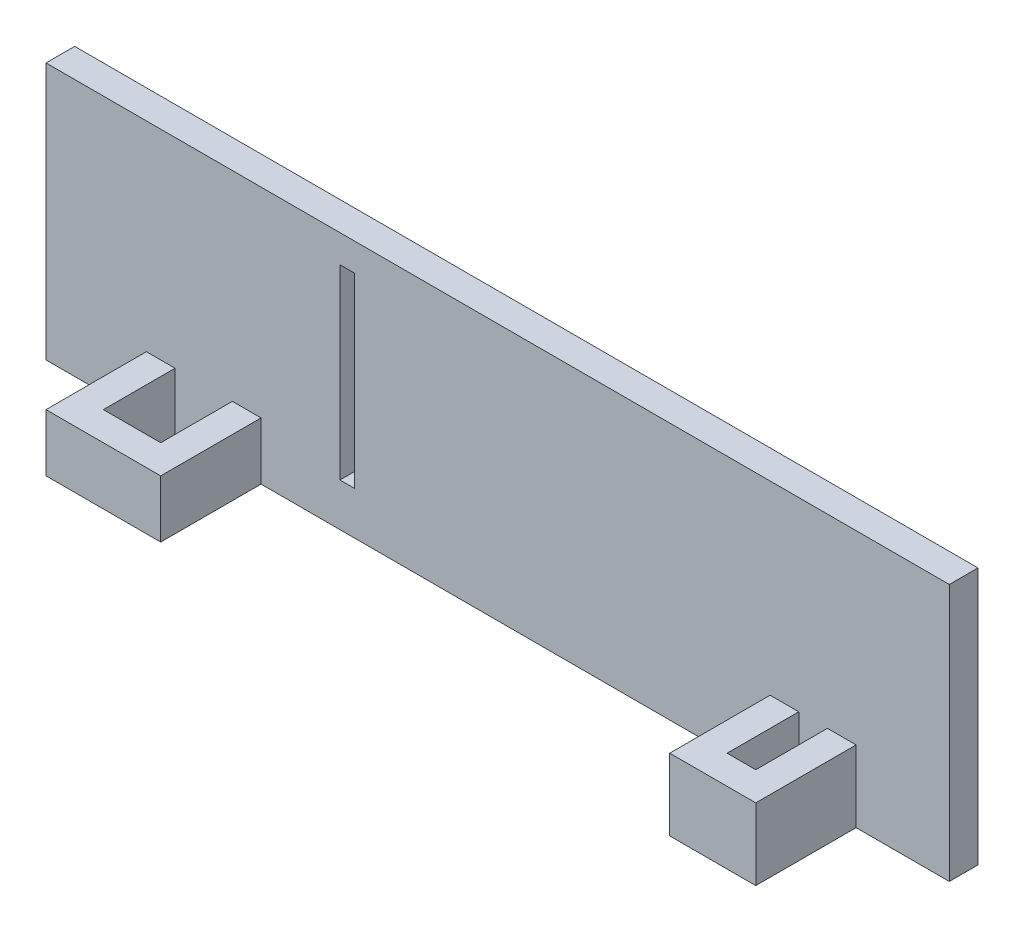
ISO-10303-21;
HEADER;
FILE_DESCRIPTION(('STEP AP214'),'2;1');
FILE_NAME('part.step','',(''),(''),'','','');
FILE_SCHEMA(('AUTOMOTIVE_DESIGN { 1 0 10303 214 1 1 1 1 }'));
ENDSEC;
DATA;
#1=APPLICATION_CONTEXT('core data for automotive mechanical design processes');
#2=APPLICATION_PROTOCOL_DEFINITION('international standard','automotive_design',2000,#1);
#3=PRODUCT_CONTEXT('',#1,'mechanical');
#4=PRODUCT('Part','Part','',(#3));
#5=PRODUCT_RELATED_PRODUCT_CATEGORY('part','',(#4));
#6=PRODUCT_DEFINITION_FORMATION('','',#4);
#7=PRODUCT_DEFINITION_CONTEXT('part definition',#1,'design');
#8=PRODUCT_DEFINITION('design','',#6,#7);
#9=PRODUCT_DEFINITION_SHAPE('','',#8);
#10=(LENGTH_UNIT() NAMED_UNIT(*) SI_UNIT(.MILLI.,.METRE.));
#11=(NAMED_UNIT(*) PLANE_ANGLE_UNIT() SI_UNIT($,.RADIAN.));
#12=(NAMED_UNIT(*) SI_UNIT($,.STERADIAN.) SOLID_ANGLE_UNIT());
#13=UNCERTAINTY_MEASURE_WITH_UNIT(LENGTH_MEASURE(1.E-05),#10,'distance_accuracy_value','');
#14=(GEOMETRIC_REPRESENTATION_CONTEXT(3) GLOBAL_UNCERTAINTY_ASSIGNED_CONTEXT((#13)) GLOBAL_UNIT_ASSIGNED_CONTEXT((#10,
#11,#12)) REPRESENTATION_CONTEXT('',''));
#15=CARTESIAN_POINT('',(0.,0.,0.));
#16=DIRECTION('',(0.,0.,1.));
#17=DIRECTION('',(1.,0.,0.));
#18=AXIS2_PLACEMENT_3D('',#15,#16,#17);
#19=CARTESIAN_POINT('',(0.,0.,2.));
#20=DIRECTION('',(0.,0.,1.));
#21=DIRECTION('',(1.,0.,0.));
#22=AXIS2_PLACEMENT_3D('',#19,#20,#21);
#23=PLANE('',#22);
#24=DIRECTION('',(1.,0.,0.));
#25=VECTOR('',#24,1.);
#26=CARTESIAN_POINT('',(0.,-84.5096429935089,2.));
#27=LINE('',#26,#25);
#28=CARTESIAN_POINT('',(0.,-84.5096429935089,2.));
#29=VERTEX_POINT('',#28);
#30=CARTESIAN_POINT('',(63.,-84.5096429935089,2.));
#31=VERTEX_POINT('',#30);
#32=EDGE_CURVE('E389',#29,#31,#27,.T.);
#33=ORIENTED_EDGE('',*,*,#32,.F.);
#34=DIRECTION('',(0.,-1.,0.));
#35=VECTOR('',#34,1.);
#36=CARTESIAN_POINT('',(0.,0.,2.));
#37=LINE('',#36,#35);
#38=CARTESIAN_POINT('',(0.,-102.45,2.));
#39=VERTEX_POINT('',#38);
#40=EDGE_CURVE('E207',#29,#39,#37,.T.);
#41=ORIENTED_EDGE('',*,*,#40,.T.);
#42=DIRECTION('',(1.,0.,0.));
#43=VECTOR('',#42,1.);
#44=CARTESIAN_POINT('',(0.,-102.45,2.));
#45=LINE('',#44,#43);
#46=CARTESIAN_POINT('',(7.,-102.45,2.));
#47=VERTEX_POINT('',#46);
#48=EDGE_CURVE('E217',#39,#47,#45,.T.);
#49=ORIENTED_EDGE('',*,*,#48,.T.);
#50=DIRECTION('',(0.,-1.,0.));
#51=VECTOR('',#50,1.);
#52=CARTESIAN_POINT('',(7.,-102.45,2.));
#53=LINE('',#52,#51);
#54=CARTESIAN_POINT('',(7.,-98.45,2.));
#55=VERTEX_POINT('',#54);
#56=EDGE_CURVE('E345',#55,#47,#53,.T.);
#57=ORIENTED_EDGE('',*,*,#56,.F.);
#58=DIRECTION('',(-1.,0.,0.));
#59=VECTOR('',#58,1.);
#60=CARTESIAN_POINT('',(7.,-98.45,2.));
#61=LINE('',#60,#59);
#62=CARTESIAN_POINT('',(9.,-98.45,2.));
#63=VERTEX_POINT('',#62);
#64=EDGE_CURVE('E362',#63,#55,#61,.T.);
#65=ORIENTED_EDGE('',*,*,#64,.F.);
#66=DIRECTION('',(0.,-1.,0.));
#67=VECTOR('',#66,1.);
#68=CARTESIAN_POINT('',(9.,-97.45,2.));
#69=LINE('',#68,#67);
#70=CARTESIAN_POINT('',(9.,-102.45,2.));
#71=VERTEX_POINT('',#70);
#72=EDGE_CURVE('E278',#63,#71,#69,.T.);
#73=ORIENTED_EDGE('',*,*,#72,.T.);
#74=DIRECTION('',(1.,0.,0.));
#75=VECTOR('',#74,1.);
#76=CARTESIAN_POINT('',(9.,-102.45,2.));
#77=LINE('',#76,#75);
#78=CARTESIAN_POINT('',(13.,-102.45,2.));
#79=VERTEX_POINT('',#78);
#80=EDGE_CURVE('E268',#71,#79,#77,.T.);
#81=ORIENTED_EDGE('',*,*,#80,.T.);
#82=DIRECTION('',(0.,-1.,0.));
#83=VECTOR('',#82,1.);
#84=CARTESIAN_POINT('',(13.,-97.45,2.));
#85=LINE('',#84,#83);
#86=CARTESIAN_POINT('',(13.,-98.45,2.));
#87=VERTEX_POINT('',#86);
#88=EDGE_CURVE('E284',#87,#79,#85,.T.);
#89=ORIENTED_EDGE('',*,*,#88,.F.);
#90=CARTESIAN_POINT('',(15.,-98.45,2.));
#91=VERTEX_POINT('',#90);
#92=EDGE_CURVE('E350',#91,#87,#61,.T.);
#93=ORIENTED_EDGE('',*,*,#92,.F.);
#94=DIRECTION('',(0.,1.,0.));
#95=VECTOR('',#94,1.);
#96=CARTESIAN_POINT('',(15.,-102.45,2.));
#97=LINE('',#96,#95);
#98=CARTESIAN_POINT('',(15.,-102.45,2.));
#99=VERTEX_POINT('',#98);
#100=EDGE_CURVE('E359',#99,#91,#97,.T.);
#101=ORIENTED_EDGE('',*,*,#100,.F.);
#102=CARTESIAN_POINT('',(50.5,-102.45,2.));
#103=VERTEX_POINT('',#102);
#104=EDGE_CURVE('E375',#99,#103,#45,.T.);
#105=ORIENTED_EDGE('',*,*,#104,.T.);
#106=DIRECTION('',(0.,-1.,0.));
#107=VECTOR('',#106,1.);
#108=CARTESIAN_POINT('',(50.5,-102.45,2.));
#109=LINE('',#108,#107);
#110=CARTESIAN_POINT('',(50.5,-97.45,2.));
#111=VERTEX_POINT('',#110);
#112=EDGE_CURVE('E281',#111,#103,#109,.T.);
#113=ORIENTED_EDGE('',*,*,#112,.F.);
#114=DIRECTION('',(-1.,0.,0.));
#115=VECTOR('',#114,1.);
#116=CARTESIAN_POINT('',(50.5,-97.45,2.));
#117=LINE('',#116,#115);
#118=CARTESIAN_POINT('',(52.5,-97.45,2.));
#119=VERTEX_POINT('',#118);
#120=EDGE_CURVE('E331',#119,#111,#117,.T.);
#121=ORIENTED_EDGE('',*,*,#120,.F.);
#122=DIRECTION('',(0.,-1.,0.));
#123=VECTOR('',#122,1.);
#124=CARTESIAN_POINT('',(52.5,-97.45,2.));
#125=LINE('',#124,#123);
#126=CARTESIAN_POINT('',(52.5,-102.45,2.));
#127=VERTEX_POINT('',#126);
#128=EDGE_CURVE('E298',#119,#127,#125,.T.);
#129=ORIENTED_EDGE('',*,*,#128,.T.);
#130=DIRECTION('',(1.,0.,0.));
#131=VECTOR('',#130,1.);
#132=CARTESIAN_POINT('',(52.5,-102.45,2.));
#133=LINE('',#132,#131);
#134=CARTESIAN_POINT('',(54.5,-102.45,2.));
#135=VERTEX_POINT('',#134);
#136=EDGE_CURVE('E300',#127,#135,#133,.T.);
#137=ORIENTED_EDGE('',*,*,#136,.T.);
#138=DIRECTION('',(0.,-1.,0.));
#139=VECTOR('',#138,1.);
#140=CARTESIAN_POINT('',(54.5,-97.45,2.));
#141=LINE('',#140,#139);
#142=CARTESIAN_POINT('',(54.5,-97.45,2.));
#143=VERTEX_POINT('',#142);
#144=EDGE_CURVE('E311',#143,#135,#141,.T.);
#145=ORIENTED_EDGE('',*,*,#144,.F.);
#146=CARTESIAN_POINT('',(56.5,-97.45,2.));
#147=VERTEX_POINT('',#146);
#148=EDGE_CURVE('E319',#147,#143,#117,.T.);
#149=ORIENTED_EDGE('',*,*,#148,.F.);
#150=DIRECTION('',(0.,1.,0.));
#151=VECTOR('',#150,1.);
#152=CARTESIAN_POINT('',(56.5,-102.45,2.));
#153=LINE('',#152,#151);
#154=CARTESIAN_POINT('',(56.5,-102.45,2.));
#155=VERTEX_POINT('',#154);
#156=EDGE_CURVE('E328',#155,#147,#153,.T.);
#157=ORIENTED_EDGE('',*,*,#156,.F.);
#158=CARTESIAN_POINT('',(63.,-102.45,2.));
#159=VERTEX_POINT('',#158);
#160=EDGE_CURVE('E373',#155,#159,#45,.T.);
#161=ORIENTED_EDGE('',*,*,#160,.T.);
#162=DIRECTION('',(0.,-1.,0.));
#163=VECTOR('',#162,1.);
#164=CARTESIAN_POINT('',(63.,-54.,2.));
#165=LINE('',#164,#163);
#166=EDGE_CURVE('E213',#31,#159,#165,.T.);
#167=ORIENTED_EDGE('',*,*,#166,.F.);
#168=EDGE_LOOP('',(#33,#41,#49,#57,#65,#73,#81,#89,#93,#101,#105,#113,#121,#129,#137,#145,#149,
#157,#161,#167));
#169=FACE_BOUND('',#168,.T.);
#170=DIRECTION('',(0.,-1.,0.));
#171=VECTOR('',#170,1.);
#172=CARTESIAN_POINT('',(20.5,-86.45,2.));
#173=LINE('',#172,#171);
#174=CARTESIAN_POINT('',(20.5,-86.45,2.));
#175=VERTEX_POINT('',#174);
#176=CARTESIAN_POINT('',(20.5,-99.45,2.));
#177=VERTEX_POINT('',#176);
#178=EDGE_CURVE('E56',#175,#177,#173,.T.);
#179=ORIENTED_EDGE('',*,*,#178,.F.);
#180=DIRECTION('',(-1.,0.,0.));
#181=VECTOR('',#180,1.);
#182=CARTESIAN_POINT('',(20.5,-86.45,2.));
#183=LINE('',#182,#181);
#184=CARTESIAN_POINT('',(21.5,-86.45,2.));
#185=VERTEX_POINT('',#184);
#186=EDGE_CURVE('E265',#185,#175,#183,.T.);
#187=ORIENTED_EDGE('',*,*,#186,.F.);
#188=DIRECTION('',(0.,1.,0.));
#189=VECTOR('',#188,1.);
#190=CARTESIAN_POINT('',(21.5,-86.45,2.));
#191=LINE('',#190,#189);
#192=CARTESIAN_POINT('',(21.5,-99.45,2.));
#193=VERTEX_POINT('',#192);
#194=EDGE_CURVE('E254',#193,#185,#191,.T.);
#195=ORIENTED_EDGE('',*,*,#194,.F.);
#196=DIRECTION('',(1.,0.,0.));
#197=VECTOR('',#196,1.);
#198=CARTESIAN_POINT('',(20.5,-99.45,2.));
#199=LINE('',#198,#197);
#200=EDGE_CURVE('E394',#177,#193,#199,.T.);
#201=ORIENTED_EDGE('',*,*,#200,.F.);
#202=EDGE_LOOP('',(#179,#187,#195,#201));
#203=FACE_BOUND('',#202,.T.);
#204=ADVANCED_FACE('F33',(#169,#203),#23,.T.);
#205=CARTESIAN_POINT('',(0.,0.,2.));
#206=DIRECTION('',(1.,0.,0.));
#207=DIRECTION('',(0.,1.,0.));
#208=AXIS2_PLACEMENT_3D('',#205,#206,#207);
#209=PLANE('',#208);
#210=ORIENTED_EDGE('',*,*,#40,.F.);
#211=DIRECTION('',(0.,0.,1.));
#212=VECTOR('',#211,1.);
#213=CARTESIAN_POINT('',(0.,-84.5096429935089,0.));
#214=LINE('',#213,#212);
#215=CARTESIAN_POINT('',(0.,-84.5096429935089,0.));
#216=VERTEX_POINT('',#215);
#217=EDGE_CURVE('E195',#216,#29,#214,.T.);
#218=ORIENTED_EDGE('',*,*,#217,.F.);
#219=DIRECTION('',(0.,-1.,0.));
#220=VECTOR('',#219,1.);
#221=CARTESIAN_POINT('',(0.,0.,0.));
#222=LINE('',#221,#220);
#223=CARTESIAN_POINT('',(0.,-102.45,0.));
#224=VERTEX_POINT('',#223);
#225=EDGE_CURVE('E205',#216,#224,#222,.T.);
#226=ORIENTED_EDGE('',*,*,#225,.T.);
#227=DIRECTION('',(0.,0.,-1.));
#228=VECTOR('',#227,1.);
#229=CARTESIAN_POINT('',(0.,-102.45,2.));
#230=LINE('',#229,#228);
#231=EDGE_CURVE('E224',#39,#224,#230,.T.);
#232=ORIENTED_EDGE('',*,*,#231,.F.);
#233=EDGE_LOOP('',(#210,#218,#226,#232));
#234=FACE_BOUND('',#233,.T.);
#235=ADVANCED_FACE('F35',(#234),#209,.F.);
#236=CARTESIAN_POINT('',(50.,-102.45,2.));
#237=DIRECTION('',(0.,1.,0.));
#238=DIRECTION('',(0.,0.,1.));
#239=AXIS2_PLACEMENT_3D('',#236,#237,#238);
#240=PLANE('',#239);
#241=ORIENTED_EDGE('',*,*,#80,.F.);
#242=DIRECTION('',(0.,0.,-1.));
#243=VECTOR('',#242,1.);
#244=CARTESIAN_POINT('',(9.,-102.45,7.));
#245=LINE('',#244,#243);
#246=CARTESIAN_POINT('',(9.,-102.45,7.));
#247=VERTEX_POINT('',#246);
#248=EDGE_CURVE('E266',#247,#71,#245,.T.);
#249=ORIENTED_EDGE('',*,*,#248,.F.);
#250=DIRECTION('',(-1.,0.,0.));
#251=VECTOR('',#250,1.);
#252=CARTESIAN_POINT('',(9.,-102.45,7.));
#253=LINE('',#252,#251);
#254=CARTESIAN_POINT('',(13.,-102.45,7.));
#255=VERTEX_POINT('',#254);
#256=EDGE_CURVE('E275',#255,#247,#253,.T.);
#257=ORIENTED_EDGE('',*,*,#256,.F.);
#258=DIRECTION('',(0.,0.,1.));
#259=VECTOR('',#258,1.);
#260=CARTESIAN_POINT('',(13.,-102.45,7.));
#261=LINE('',#260,#259);
#262=EDGE_CURVE('E272',#79,#255,#261,.T.);
#263=ORIENTED_EDGE('',*,*,#262,.F.);
#264=EDGE_LOOP('',(#241,#249,#257,#263));
#265=FACE_BOUND('',#264,.T.);
#266=ORIENTED_EDGE('',*,*,#136,.F.);
#267=DIRECTION('',(0.,0.,-1.));
#268=VECTOR('',#267,1.);
#269=CARTESIAN_POINT('',(52.5,-102.45,7.));
#270=LINE('',#269,#268);
#271=CARTESIAN_POINT('',(52.5,-102.45,7.));
#272=VERTEX_POINT('',#271);
#273=EDGE_CURVE('E258',#272,#127,#270,.T.);
#274=ORIENTED_EDGE('',*,*,#273,.F.);
#275=DIRECTION('',(-1.,0.,0.));
#276=VECTOR('',#275,1.);
#277=CARTESIAN_POINT('',(52.5,-102.45,7.));
#278=LINE('',#277,#276);
#279=CARTESIAN_POINT('',(54.5,-102.45,7.));
#280=VERTEX_POINT('',#279);
#281=EDGE_CURVE('E292',#280,#272,#278,.T.);
#282=ORIENTED_EDGE('',*,*,#281,.F.);
#283=DIRECTION('',(0.,0.,1.));
#284=VECTOR('',#283,1.);
#285=CARTESIAN_POINT('',(54.5,-102.45,7.));
#286=LINE('',#285,#284);
#287=EDGE_CURVE('E303',#135,#280,#286,.T.);
#288=ORIENTED_EDGE('',*,*,#287,.F.);
#289=EDGE_LOOP('',(#266,#274,#282,#288));
#290=FACE_BOUND('',#289,.T.);
#291=ORIENTED_EDGE('',*,*,#48,.F.);
#292=ORIENTED_EDGE('',*,*,#231,.T.);
#293=DIRECTION('',(1.,0.,0.));
#294=VECTOR('',#293,1.);
#295=CARTESIAN_POINT('',(50.,-102.45,0.));
#296=LINE('',#295,#294);
#297=CARTESIAN_POINT('',(63.,-102.45,0.));
#298=VERTEX_POINT('',#297);
#299=EDGE_CURVE('E212',#224,#298,#296,.T.);
#300=ORIENTED_EDGE('',*,*,#299,.T.);
#301=DIRECTION('',(0.,0.,-1.));
#302=VECTOR('',#301,1.);
#303=CARTESIAN_POINT('',(63.,-102.45,2.));
#304=LINE('',#303,#302);
#305=EDGE_CURVE('E222',#159,#298,#304,.T.);
#306=ORIENTED_EDGE('',*,*,#305,.F.);
#307=ORIENTED_EDGE('',*,*,#160,.F.);
#308=DIRECTION('',(0.,0.,-1.));
#309=VECTOR('',#308,1.);
#310=CARTESIAN_POINT('',(56.5,-102.45,9.));
#311=LINE('',#310,#309);
#312=CARTESIAN_POINT('',(56.5,-102.45,9.));
#313=VERTEX_POINT('',#312);
#314=EDGE_CURVE('E339',#313,#155,#311,.T.);
#315=ORIENTED_EDGE('',*,*,#314,.F.);
#316=DIRECTION('',(1.,0.,0.));
#317=VECTOR('',#316,1.);
#318=CARTESIAN_POINT('',(50.5,-102.45,9.));
#319=LINE('',#318,#317);
#320=CARTESIAN_POINT('',(50.5,-102.45,9.));
#321=VERTEX_POINT('',#320);
#322=EDGE_CURVE('E318',#321,#313,#319,.T.);
#323=ORIENTED_EDGE('',*,*,#322,.F.);
#324=DIRECTION('',(0.,0.,-1.));
#325=VECTOR('',#324,1.);
#326=CARTESIAN_POINT('',(50.5,-102.45,9.));
#327=LINE('',#326,#325);
#328=EDGE_CURVE('E342',#321,#103,#327,.T.);
#329=ORIENTED_EDGE('',*,*,#328,.T.);
#330=ORIENTED_EDGE('',*,*,#104,.F.);
#331=DIRECTION('',(0.,0.,-1.));
#332=VECTOR('',#331,1.);
#333=CARTESIAN_POINT('',(15.,-102.45,9.));
#334=LINE('',#333,#332);
#335=CARTESIAN_POINT('',(15.,-102.45,9.));
#336=VERTEX_POINT('',#335);
#337=EDGE_CURVE('E369',#336,#99,#334,.T.);
#338=ORIENTED_EDGE('',*,*,#337,.F.);
#339=DIRECTION('',(1.,0.,0.));
#340=VECTOR('',#339,1.);
#341=CARTESIAN_POINT('',(7.,-102.45,9.));
#342=LINE('',#341,#340);
#343=CARTESIAN_POINT('',(7.,-102.45,9.));
#344=VERTEX_POINT('',#343);
#345=EDGE_CURVE('E349',#344,#336,#342,.T.);
#346=ORIENTED_EDGE('',*,*,#345,.F.);
#347=DIRECTION('',(0.,0.,-1.));
#348=VECTOR('',#347,1.);
#349=CARTESIAN_POINT('',(7.,-102.45,9.));
#350=LINE('',#349,#348);
#351=EDGE_CURVE('E371',#344,#47,#350,.T.);
#352=ORIENTED_EDGE('',*,*,#351,.T.);
#353=EDGE_LOOP('',(#291,#292,#300,#306,#307,#315,#323,#329,#330,#338,#346,#352));
#354=FACE_BOUND('',#353,.T.);
#355=ADVANCED_FACE('F386',(#265,#290,#354),#240,.F.);
#356=CARTESIAN_POINT('',(63.,0.,2.));
#357=DIRECTION('',(-1.,0.,0.));
#358=DIRECTION('',(0.,-1.,0.));
#359=AXIS2_PLACEMENT_3D('',#356,#357,#358);
#360=PLANE('',#359);
#361=DIRECTION('',(0.,1.,0.));
#362=VECTOR('',#361,1.);
#363=CARTESIAN_POINT('',(63.,0.,0.));
#364=LINE('',#363,#362);
#365=CARTESIAN_POINT('',(63.,-84.5096429935089,0.));
#366=VERTEX_POINT('',#365);
#367=EDGE_CURVE('E215',#298,#366,#364,.T.);
#368=ORIENTED_EDGE('',*,*,#367,.T.);
#369=DIRECTION('',(0.,0.,1.));
#370=VECTOR('',#369,1.);
#371=CARTESIAN_POINT('',(63.,-84.5096429935089,0.));
#372=LINE('',#371,#370);
#373=EDGE_CURVE('E48',#366,#31,#372,.T.);
#374=ORIENTED_EDGE('',*,*,#373,.T.);
#375=ORIENTED_EDGE('',*,*,#166,.T.);
#376=ORIENTED_EDGE('',*,*,#305,.T.);
#377=EDGE_LOOP('',(#368,#374,#375,#376));
#378=FACE_BOUND('',#377,.T.);
#379=ADVANCED_FACE('F388',(#378),#360,.F.);
#380=CARTESIAN_POINT('',(0.,0.,0.));
#381=DIRECTION('',(0.,0.,1.));
#382=DIRECTION('',(1.,0.,0.));
#383=AXIS2_PLACEMENT_3D('',#380,#381,#382);
#384=PLANE('',#383);
#385=DIRECTION('',(-1.,0.,0.));
#386=VECTOR('',#385,1.);
#387=CARTESIAN_POINT('',(0.,-86.45,0.));
#388=LINE('',#387,#386);
#389=CARTESIAN_POINT('',(21.5,-86.45,0.));
#390=VERTEX_POINT('',#389);
#391=CARTESIAN_POINT('',(20.5,-86.45,0.));
#392=VERTEX_POINT('',#391);
#393=EDGE_CURVE('E41',#390,#392,#388,.T.);
#394=ORIENTED_EDGE('',*,*,#393,.T.);
#395=DIRECTION('',(0.,-1.,0.));
#396=VECTOR('',#395,1.);
#397=CARTESIAN_POINT('',(20.5,0.,0.));
#398=LINE('',#397,#396);
#399=CARTESIAN_POINT('',(20.5,-99.45,0.));
#400=VERTEX_POINT('',#399);
#401=EDGE_CURVE('E11',#392,#400,#398,.T.);
#402=ORIENTED_EDGE('',*,*,#401,.T.);
#403=DIRECTION('',(1.,0.,0.));
#404=VECTOR('',#403,1.);
#405=CARTESIAN_POINT('',(0.,-99.45,0.));
#406=LINE('',#405,#404);
#407=CARTESIAN_POINT('',(21.5,-99.45,0.));
#408=VERTEX_POINT('',#407);
#409=EDGE_CURVE('E235',#400,#408,#406,.T.);
#410=ORIENTED_EDGE('',*,*,#409,.T.);
#411=DIRECTION('',(0.,1.,0.));
#412=VECTOR('',#411,1.);
#413=CARTESIAN_POINT('',(21.5,0.,0.));
#414=LINE('',#413,#412);
#415=EDGE_CURVE('E238',#408,#390,#414,.T.);
#416=ORIENTED_EDGE('',*,*,#415,.T.);
#417=EDGE_LOOP('',(#394,#402,#410,#416));
#418=FACE_BOUND('',#417,.T.);
#419=ORIENTED_EDGE('',*,*,#225,.F.);
#420=DIRECTION('',(1.,0.,0.));
#421=VECTOR('',#420,1.);
#422=CARTESIAN_POINT('',(0.,-84.5096429935089,0.));
#423=LINE('',#422,#421);
#424=EDGE_CURVE('E192',#216,#366,#423,.T.);
#425=ORIENTED_EDGE('',*,*,#424,.T.);
#426=ORIENTED_EDGE('',*,*,#367,.F.);
#427=ORIENTED_EDGE('',*,*,#299,.F.);
#428=EDGE_LOOP('',(#419,#425,#426,#427));
#429=FACE_BOUND('',#428,.T.);
#430=ADVANCED_FACE('F210',(#418,#429),#384,.F.);
#431=CARTESIAN_POINT('',(7.,-102.45,9.));
#432=DIRECTION('',(1.,0.,0.));
#433=DIRECTION('',(0.,0.,-1.));
#434=AXIS2_PLACEMENT_3D('',#431,#432,#433);
#435=PLANE('',#434);
#436=ORIENTED_EDGE('',*,*,#56,.T.);
#437=ORIENTED_EDGE('',*,*,#351,.F.);
#438=DIRECTION('',(0.,-1.,0.));
#439=VECTOR('',#438,1.);
#440=CARTESIAN_POINT('',(7.,-102.45,9.));
#441=LINE('',#440,#439);
#442=CARTESIAN_POINT('',(7.,-98.45,9.));
#443=VERTEX_POINT('',#442);
#444=EDGE_CURVE('E346',#443,#344,#441,.T.);
#445=ORIENTED_EDGE('',*,*,#444,.F.);
#446=DIRECTION('',(0.,0.,-1.));
#447=VECTOR('',#446,1.);
#448=CARTESIAN_POINT('',(7.,-98.45,9.));
#449=LINE('',#448,#447);
#450=EDGE_CURVE('E356',#443,#55,#449,.T.);
#451=ORIENTED_EDGE('',*,*,#450,.T.);
#452=EDGE_LOOP('',(#436,#437,#445,#451));
#453=FACE_BOUND('',#452,.T.);
#454=ADVANCED_FACE('F423',(#453),#435,.F.);
#455=CARTESIAN_POINT('',(15.,-102.45,9.));
#456=DIRECTION('',(-1.,0.,0.));
#457=DIRECTION('',(0.,0.,1.));
#458=AXIS2_PLACEMENT_3D('',#455,#456,#457);
#459=PLANE('',#458);
#460=ORIENTED_EDGE('',*,*,#100,.T.);
#461=DIRECTION('',(0.,0.,-1.));
#462=VECTOR('',#461,1.);
#463=CARTESIAN_POINT('',(15.,-98.45,9.));
#464=LINE('',#463,#462);
#465=CARTESIAN_POINT('',(15.,-98.45,9.));
#466=VERTEX_POINT('',#465);
#467=EDGE_CURVE('E367',#466,#91,#464,.T.);
#468=ORIENTED_EDGE('',*,*,#467,.F.);
#469=DIRECTION('',(0.,1.,0.));
#470=VECTOR('',#469,1.);
#471=CARTESIAN_POINT('',(15.,-102.45,9.));
#472=LINE('',#471,#470);
#473=EDGE_CURVE('E352',#336,#466,#472,.T.);
#474=ORIENTED_EDGE('',*,*,#473,.F.);
#475=ORIENTED_EDGE('',*,*,#337,.T.);
#476=EDGE_LOOP('',(#460,#468,#474,#475));
#477=FACE_BOUND('',#476,.T.);
#478=ADVANCED_FACE('F487',(#477),#459,.F.);
#479=CARTESIAN_POINT('',(7.,-98.45,9.));
#480=DIRECTION('',(0.,-1.,0.));
#481=DIRECTION('',(0.,0.,-1.));
#482=AXIS2_PLACEMENT_3D('',#479,#480,#481);
#483=PLANE('',#482);
#484=DIRECTION('',(-1.,0.,0.));
#485=VECTOR('',#484,1.);
#486=CARTESIAN_POINT('',(7.,-98.45,7.));
#487=LINE('',#486,#485);
#488=CARTESIAN_POINT('',(13.,-98.45,7.));
#489=VERTEX_POINT('',#488);
#490=CARTESIAN_POINT('',(9.,-98.45,7.));
#491=VERTEX_POINT('',#490);
#492=EDGE_CURVE('E229',#489,#491,#487,.T.);
#493=ORIENTED_EDGE('',*,*,#492,.T.);
#494=DIRECTION('',(0.,0.,-1.));
#495=VECTOR('',#494,1.);
#496=CARTESIAN_POINT('',(9.,-98.45,9.));
#497=LINE('',#496,#495);
#498=EDGE_CURVE('E232',#491,#63,#497,.T.);
#499=ORIENTED_EDGE('',*,*,#498,.T.);
#500=ORIENTED_EDGE('',*,*,#64,.T.);
#501=ORIENTED_EDGE('',*,*,#450,.F.);
#502=DIRECTION('',(-1.,0.,0.));
#503=VECTOR('',#502,1.);
#504=CARTESIAN_POINT('',(7.,-98.45,9.));
#505=LINE('',#504,#503);
#506=EDGE_CURVE('E354',#466,#443,#505,.T.);
#507=ORIENTED_EDGE('',*,*,#506,.F.);
#508=ORIENTED_EDGE('',*,*,#467,.T.);
#509=ORIENTED_EDGE('',*,*,#92,.T.);
#510=DIRECTION('',(0.,0.,1.));
#511=VECTOR('',#510,1.);
#512=CARTESIAN_POINT('',(13.,-98.45,9.));
#513=LINE('',#512,#511);
#514=EDGE_CURVE('E226',#87,#489,#513,.T.);
#515=ORIENTED_EDGE('',*,*,#514,.T.);
#516=EDGE_LOOP('',(#493,#499,#500,#501,#507,#508,#509,#515));
#517=FACE_BOUND('',#516,.T.);
#518=ADVANCED_FACE('F484',(#517),#483,.F.);
#519=CARTESIAN_POINT('',(0.,0.,9.));
#520=DIRECTION('',(0.,0.,-1.));
#521=DIRECTION('',(-1.,0.,0.));
#522=AXIS2_PLACEMENT_3D('',#519,#520,#521);
#523=PLANE('',#522);
#524=ORIENTED_EDGE('',*,*,#444,.T.);
#525=ORIENTED_EDGE('',*,*,#345,.T.);
#526=ORIENTED_EDGE('',*,*,#473,.T.);
#527=ORIENTED_EDGE('',*,*,#506,.T.);
#528=EDGE_LOOP('',(#524,#525,#526,#527));
#529=FACE_BOUND('',#528,.T.);
#530=ADVANCED_FACE('F480',(#529),#523,.F.);
#531=CARTESIAN_POINT('',(50.5,-102.45,9.));
#532=DIRECTION('',(1.,0.,0.));
#533=DIRECTION('',(0.,0.,-1.));
#534=AXIS2_PLACEMENT_3D('',#531,#532,#533);
#535=PLANE('',#534);
#536=ORIENTED_EDGE('',*,*,#112,.T.);
#537=ORIENTED_EDGE('',*,*,#328,.F.);
#538=DIRECTION('',(0.,-1.,0.));
#539=VECTOR('',#538,1.);
#540=CARTESIAN_POINT('',(50.5,-102.45,9.));
#541=LINE('',#540,#539);
#542=CARTESIAN_POINT('',(50.5,-97.45,9.));
#543=VERTEX_POINT('',#542);
#544=EDGE_CURVE('E315',#543,#321,#541,.T.);
#545=ORIENTED_EDGE('',*,*,#544,.F.);
#546=DIRECTION('',(0.,0.,-1.));
#547=VECTOR('',#546,1.);
#548=CARTESIAN_POINT('',(50.5,-97.45,9.));
#549=LINE('',#548,#547);
#550=EDGE_CURVE('E325',#543,#111,#549,.T.);
#551=ORIENTED_EDGE('',*,*,#550,.T.);
#552=EDGE_LOOP('',(#536,#537,#545,#551));
#553=FACE_BOUND('',#552,.T.);
#554=ADVANCED_FACE('F476',(#553),#535,.F.);
#555=CARTESIAN_POINT('',(56.5,-102.45,9.));
#556=DIRECTION('',(-1.,0.,0.));
#557=DIRECTION('',(0.,0.,1.));
#558=AXIS2_PLACEMENT_3D('',#555,#556,#557);
#559=PLANE('',#558);
#560=ORIENTED_EDGE('',*,*,#156,.T.);
#561=DIRECTION('',(0.,0.,-1.));
#562=VECTOR('',#561,1.);
#563=CARTESIAN_POINT('',(56.5,-97.45,9.));
#564=LINE('',#563,#562);
#565=CARTESIAN_POINT('',(56.5,-97.45,9.));
#566=VERTEX_POINT('',#565);
#567=EDGE_CURVE('E336',#566,#147,#564,.T.);
#568=ORIENTED_EDGE('',*,*,#567,.F.);
#569=DIRECTION('',(0.,1.,0.));
#570=VECTOR('',#569,1.);
#571=CARTESIAN_POINT('',(56.5,-102.45,9.));
#572=LINE('',#571,#570);
#573=EDGE_CURVE('E321',#313,#566,#572,.T.);
#574=ORIENTED_EDGE('',*,*,#573,.F.);
#575=ORIENTED_EDGE('',*,*,#314,.T.);
#576=EDGE_LOOP('',(#560,#568,#574,#575));
#577=FACE_BOUND('',#576,.T.);
#578=ADVANCED_FACE('F473',(#577),#559,.F.);
#579=CARTESIAN_POINT('',(50.5,-97.45,9.));
#580=DIRECTION('',(0.,-1.,0.));
#581=DIRECTION('',(0.,0.,-1.));
#582=AXIS2_PLACEMENT_3D('',#579,#580,#581);
#583=PLANE('',#582);
#584=DIRECTION('',(-1.,0.,0.));
#585=VECTOR('',#584,1.);
#586=CARTESIAN_POINT('',(52.5,-97.45,7.));
#587=LINE('',#586,#585);
#588=CARTESIAN_POINT('',(54.5,-97.45,7.));
#589=VERTEX_POINT('',#588);
#590=CARTESIAN_POINT('',(52.5,-97.45,7.));
#591=VERTEX_POINT('',#590);
#592=EDGE_CURVE('E295',#589,#591,#587,.T.);
#593=ORIENTED_EDGE('',*,*,#592,.T.);
#594=DIRECTION('',(0.,0.,-1.));
#595=VECTOR('',#594,1.);
#596=CARTESIAN_POINT('',(52.5,-97.45,7.));
#597=LINE('',#596,#595);
#598=EDGE_CURVE('E288',#591,#119,#597,.T.);
#599=ORIENTED_EDGE('',*,*,#598,.T.);
#600=ORIENTED_EDGE('',*,*,#120,.T.);
#601=ORIENTED_EDGE('',*,*,#550,.F.);
#602=DIRECTION('',(-1.,0.,0.));
#603=VECTOR('',#602,1.);
#604=CARTESIAN_POINT('',(50.5,-97.45,9.));
#605=LINE('',#604,#603);
#606=EDGE_CURVE('E323',#566,#543,#605,.T.);
#607=ORIENTED_EDGE('',*,*,#606,.F.);
#608=ORIENTED_EDGE('',*,*,#567,.T.);
#609=ORIENTED_EDGE('',*,*,#148,.T.);
#610=DIRECTION('',(0.,0.,1.));
#611=VECTOR('',#610,1.);
#612=CARTESIAN_POINT('',(54.5,-97.45,7.));
#613=LINE('',#612,#611);
#614=EDGE_CURVE('E291',#143,#589,#613,.T.);
#615=ORIENTED_EDGE('',*,*,#614,.T.);
#616=EDGE_LOOP('',(#593,#599,#600,#601,#607,#608,#609,#615));
#617=FACE_BOUND('',#616,.T.);
#618=ADVANCED_FACE('F447',(#617),#583,.F.);
#619=CARTESIAN_POINT('',(0.,0.,9.));
#620=DIRECTION('',(0.,0.,-1.));
#621=DIRECTION('',(-1.,0.,0.));
#622=AXIS2_PLACEMENT_3D('',#619,#620,#621);
#623=PLANE('',#622);
#624=ORIENTED_EDGE('',*,*,#544,.T.);
#625=ORIENTED_EDGE('',*,*,#322,.T.);
#626=ORIENTED_EDGE('',*,*,#573,.T.);
#627=ORIENTED_EDGE('',*,*,#606,.T.);
#628=EDGE_LOOP('',(#624,#625,#626,#627));
#629=FACE_BOUND('',#628,.T.);
#630=ADVANCED_FACE('F467',(#629),#623,.F.);
#631=CARTESIAN_POINT('',(52.5,-97.45,7.));
#632=DIRECTION('',(-1.,0.,0.));
#633=DIRECTION('',(0.,0.,1.));
#634=AXIS2_PLACEMENT_3D('',#631,#632,#633);
#635=PLANE('',#634);
#636=ORIENTED_EDGE('',*,*,#273,.T.);
#637=ORIENTED_EDGE('',*,*,#128,.F.);
#638=ORIENTED_EDGE('',*,*,#598,.F.);
#639=DIRECTION('',(0.,-1.,0.));
#640=VECTOR('',#639,1.);
#641=CARTESIAN_POINT('',(52.5,-97.45,7.));
#642=LINE('',#641,#640);
#643=EDGE_CURVE('E269',#591,#272,#642,.T.);
#644=ORIENTED_EDGE('',*,*,#643,.T.);
#645=EDGE_LOOP('',(#636,#637,#638,#644));
#646=FACE_BOUND('',#645,.T.);
#647=ADVANCED_FACE('F445',(#646),#635,.F.);
#648=CARTESIAN_POINT('',(52.5,-97.45,7.));
#649=DIRECTION('',(0.,0.,1.));
#650=DIRECTION('',(1.,0.,0.));
#651=AXIS2_PLACEMENT_3D('',#648,#649,#650);
#652=PLANE('',#651);
#653=ORIENTED_EDGE('',*,*,#281,.T.);
#654=ORIENTED_EDGE('',*,*,#643,.F.);
#655=ORIENTED_EDGE('',*,*,#592,.F.);
#656=DIRECTION('',(0.,-1.,0.));
#657=VECTOR('',#656,1.);
#658=CARTESIAN_POINT('',(54.5,-97.45,7.));
#659=LINE('',#658,#657);
#660=EDGE_CURVE('E309',#589,#280,#659,.T.);
#661=ORIENTED_EDGE('',*,*,#660,.T.);
#662=EDGE_LOOP('',(#653,#654,#655,#661));
#663=FACE_BOUND('',#662,.T.);
#664=ADVANCED_FACE('F451',(#663),#652,.F.);
#665=CARTESIAN_POINT('',(54.5,-97.45,7.));
#666=DIRECTION('',(1.,0.,0.));
#667=DIRECTION('',(0.,0.,-1.));
#668=AXIS2_PLACEMENT_3D('',#665,#666,#667);
#669=PLANE('',#668);
#670=ORIENTED_EDGE('',*,*,#287,.T.);
#671=ORIENTED_EDGE('',*,*,#660,.F.);
#672=ORIENTED_EDGE('',*,*,#614,.F.);
#673=ORIENTED_EDGE('',*,*,#144,.T.);
#674=EDGE_LOOP('',(#670,#671,#672,#673));
#675=FACE_BOUND('',#674,.T.);
#676=ADVANCED_FACE('F453',(#675),#669,.F.);
#677=CARTESIAN_POINT('',(9.,-97.45,7.));
#678=DIRECTION('',(-1.,0.,0.));
#679=DIRECTION('',(0.,0.,1.));
#680=AXIS2_PLACEMENT_3D('',#677,#678,#679);
#681=PLANE('',#680);
#682=DIRECTION('',(0.,-1.,0.));
#683=VECTOR('',#682,1.);
#684=CARTESIAN_POINT('',(9.,-97.45,7.));
#685=LINE('',#684,#683);
#686=EDGE_CURVE('E279',#491,#247,#685,.T.);
#687=ORIENTED_EDGE('',*,*,#686,.T.);
#688=ORIENTED_EDGE('',*,*,#248,.T.);
#689=ORIENTED_EDGE('',*,*,#72,.F.);
#690=ORIENTED_EDGE('',*,*,#498,.F.);
#691=EDGE_LOOP('',(#687,#688,#689,#690));
#692=FACE_BOUND('',#691,.T.);
#693=ADVANCED_FACE('F455',(#692),#681,.F.);
#694=CARTESIAN_POINT('',(9.,-97.45,7.));
#695=DIRECTION('',(0.,0.,1.));
#696=DIRECTION('',(1.,0.,0.));
#697=AXIS2_PLACEMENT_3D('',#694,#695,#696);
#698=PLANE('',#697);
#699=DIRECTION('',(0.,-1.,0.));
#700=VECTOR('',#699,1.);
#701=CARTESIAN_POINT('',(13.,-97.45,7.));
#702=LINE('',#701,#700);
#703=EDGE_CURVE('E282',#489,#255,#702,.T.);
#704=ORIENTED_EDGE('',*,*,#703,.T.);
#705=ORIENTED_EDGE('',*,*,#256,.T.);
#706=ORIENTED_EDGE('',*,*,#686,.F.);
#707=ORIENTED_EDGE('',*,*,#492,.F.);
#708=EDGE_LOOP('',(#704,#705,#706,#707));
#709=FACE_BOUND('',#708,.T.);
#710=ADVANCED_FACE('F409',(#709),#698,.F.);
#711=CARTESIAN_POINT('',(13.,-97.45,7.));
#712=DIRECTION('',(1.,0.,0.));
#713=DIRECTION('',(0.,0.,-1.));
#714=AXIS2_PLACEMENT_3D('',#711,#712,#713);
#715=PLANE('',#714);
#716=ORIENTED_EDGE('',*,*,#88,.T.);
#717=ORIENTED_EDGE('',*,*,#262,.T.);
#718=ORIENTED_EDGE('',*,*,#703,.F.);
#719=ORIENTED_EDGE('',*,*,#514,.F.);
#720=EDGE_LOOP('',(#716,#717,#718,#719));
#721=FACE_BOUND('',#720,.T.);
#722=ADVANCED_FACE('F402',(#721),#715,.F.);
#723=CARTESIAN_POINT('',(20.5,-86.45,-8.));
#724=DIRECTION('',(-1.,0.,0.));
#725=DIRECTION('',(0.,-1.,0.));
#726=AXIS2_PLACEMENT_3D('',#723,#724,#725);
#727=PLANE('',#726);
#728=DIRECTION('',(0.,0.,1.));
#729=VECTOR('',#728,1.);
#730=CARTESIAN_POINT('',(20.5,-86.45,-8.));
#731=LINE('',#730,#729);
#732=EDGE_CURVE('E250',#392,#175,#731,.T.);
#733=ORIENTED_EDGE('',*,*,#732,.T.);
#734=ORIENTED_EDGE('',*,*,#178,.T.);
#735=DIRECTION('',(0.,0.,1.));
#736=VECTOR('',#735,1.);
#737=CARTESIAN_POINT('',(20.5,-99.45,-8.));
#738=LINE('',#737,#736);
#739=EDGE_CURVE('E260',#400,#177,#738,.T.);
#740=ORIENTED_EDGE('',*,*,#739,.F.);
#741=ORIENTED_EDGE('',*,*,#401,.F.);
#742=EDGE_LOOP('',(#733,#734,#740,#741));
#743=FACE_BOUND('',#742,.T.);
#744=ADVANCED_FACE('F400',(#743),#727,.F.);
#745=CARTESIAN_POINT('',(20.5,-86.45,-8.));
#746=DIRECTION('',(0.,1.,0.));
#747=DIRECTION('',(0.,0.,1.));
#748=AXIS2_PLACEMENT_3D('',#745,#746,#747);
#749=PLANE('',#748);
#750=DIRECTION('',(0.,0.,1.));
#751=VECTOR('',#750,1.);
#752=CARTESIAN_POINT('',(21.5,-86.45,-8.));
#753=LINE('',#752,#751);
#754=EDGE_CURVE('E248',#390,#185,#753,.T.);
#755=ORIENTED_EDGE('',*,*,#754,.T.);
#756=ORIENTED_EDGE('',*,*,#186,.T.);
#757=ORIENTED_EDGE('',*,*,#732,.F.);
#758=ORIENTED_EDGE('',*,*,#393,.F.);
#759=EDGE_LOOP('',(#755,#756,#757,#758));
#760=FACE_BOUND('',#759,.T.);
#761=ADVANCED_FACE('F246',(#760),#749,.F.);
#762=CARTESIAN_POINT('',(21.5,-86.45,-8.));
#763=DIRECTION('',(1.,0.,0.));
#764=DIRECTION('',(0.,1.,0.));
#765=AXIS2_PLACEMENT_3D('',#762,#763,#764);
#766=PLANE('',#765);
#767=DIRECTION('',(0.,0.,1.));
#768=VECTOR('',#767,1.);
#769=CARTESIAN_POINT('',(21.5,-99.45,-8.));
#770=LINE('',#769,#768);
#771=EDGE_CURVE('E256',#408,#193,#770,.T.);
#772=ORIENTED_EDGE('',*,*,#771,.T.);
#773=ORIENTED_EDGE('',*,*,#194,.T.);
#774=ORIENTED_EDGE('',*,*,#754,.F.);
#775=ORIENTED_EDGE('',*,*,#415,.F.);
#776=EDGE_LOOP('',(#772,#773,#774,#775));
#777=FACE_BOUND('',#776,.T.);
#778=ADVANCED_FACE('F252',(#777),#766,.F.);
#779=CARTESIAN_POINT('',(20.5,-99.45,-8.));
#780=DIRECTION('',(0.,-1.,0.));
#781=DIRECTION('',(0.,0.,-1.));
#782=AXIS2_PLACEMENT_3D('',#779,#780,#781);
#783=PLANE('',#782);
#784=ORIENTED_EDGE('',*,*,#739,.T.);
#785=ORIENTED_EDGE('',*,*,#200,.T.);
#786=ORIENTED_EDGE('',*,*,#771,.F.);
#787=ORIENTED_EDGE('',*,*,#409,.F.);
#788=EDGE_LOOP('',(#784,#785,#786,#787));
#789=FACE_BOUND('',#788,.T.);
#790=ADVANCED_FACE('F399',(#789),#783,.F.);
#791=CARTESIAN_POINT('',(0.,-84.5096429935089,0.));
#792=DIRECTION('',(0.,-1.,0.));
#793=DIRECTION('',(0.,0.,-1.));
#794=AXIS2_PLACEMENT_3D('',#791,#792,#793);
#795=PLANE('',#794);
#796=ORIENTED_EDGE('',*,*,#32,.T.);
#797=ORIENTED_EDGE('',*,*,#373,.F.);
#798=ORIENTED_EDGE('',*,*,#424,.F.);
#799=ORIENTED_EDGE('',*,*,#217,.T.);
#800=EDGE_LOOP('',(#796,#797,#798,#799));
#801=FACE_BOUND('',#800,.T.);
#802=ADVANCED_FACE('F194',(#801),#795,.F.);
#803=CLOSED_SHELL('',(#204,#235,#355,#379,#430,#454,#478,#518,#530,#554,#578,#618,#630,#647,
#664,#676,#693,#710,#722,#744,#761,#778,#790,#802));
#804=MANIFOLD_SOLID_BREP('B2',#803);
#805=ADVANCED_BREP_SHAPE_REPRESENTATION('',(#18,#804),#14);
#806=SHAPE_DEFINITION_REPRESENTATION(#9,#805);
ENDSEC;
END-ISO-10303-21;
